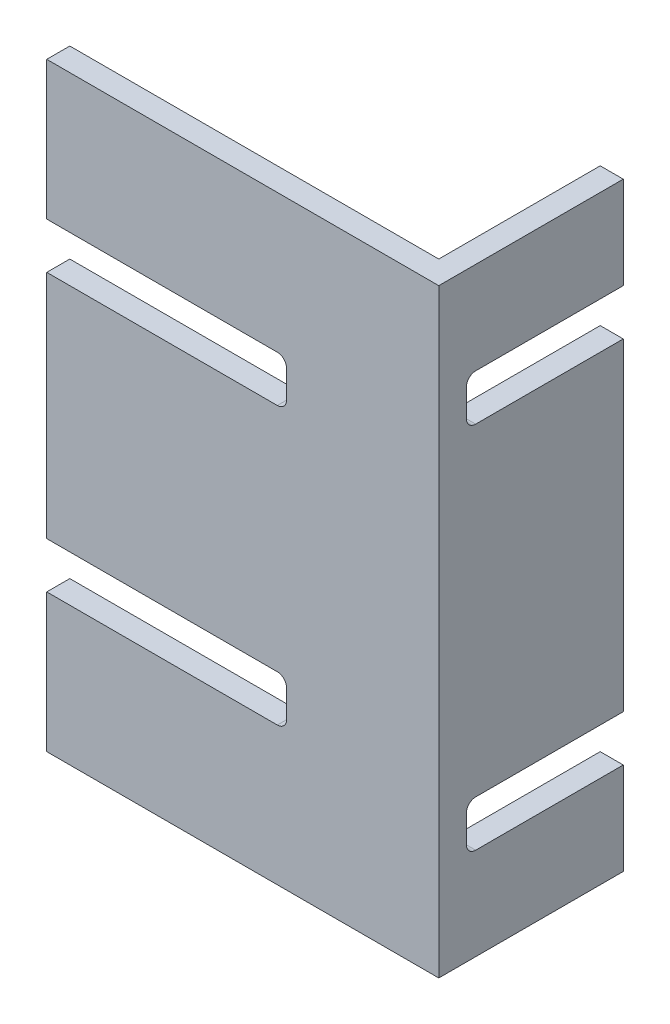
ISO-10303-21;
HEADER;
FILE_DESCRIPTION(('STEP AP214'),'2;1');
FILE_NAME('part.step','',(''),(''),'','','');
FILE_SCHEMA(('AUTOMOTIVE_DESIGN { 1 0 10303 214 1 1 1 1 }'));
ENDSEC;
DATA;
#1=APPLICATION_CONTEXT('core data for automotive mechanical design processes');
#2=APPLICATION_PROTOCOL_DEFINITION('international standard','automotive_design',2000,#1);
#3=PRODUCT_CONTEXT('',#1,'mechanical');
#4=PRODUCT('Part','Part','',(#3));
#5=PRODUCT_RELATED_PRODUCT_CATEGORY('part','',(#4));
#6=PRODUCT_DEFINITION_FORMATION('','',#4);
#7=PRODUCT_DEFINITION_CONTEXT('part definition',#1,'design');
#8=PRODUCT_DEFINITION('design','',#6,#7);
#9=PRODUCT_DEFINITION_SHAPE('','',#8);
#10=(LENGTH_UNIT() NAMED_UNIT(*) SI_UNIT(.MILLI.,.METRE.));
#11=(NAMED_UNIT(*) PLANE_ANGLE_UNIT() SI_UNIT($,.RADIAN.));
#12=(NAMED_UNIT(*) SI_UNIT($,.STERADIAN.) SOLID_ANGLE_UNIT());
#13=UNCERTAINTY_MEASURE_WITH_UNIT(LENGTH_MEASURE(1.E-05),#10,'distance_accuracy_value','');
#14=(GEOMETRIC_REPRESENTATION_CONTEXT(3) GLOBAL_UNCERTAINTY_ASSIGNED_CONTEXT((#13)) GLOBAL_UNIT_ASSIGNED_CONTEXT((#10,
#11,#12)) REPRESENTATION_CONTEXT('',''));
#15=CARTESIAN_POINT('',(0.,0.,0.));
#16=DIRECTION('',(0.,0.,1.));
#17=DIRECTION('',(1.,0.,0.));
#18=AXIS2_PLACEMENT_3D('',#15,#16,#17);
#19=CARTESIAN_POINT('',(-95.3401550608828,130.,28.7075123668189));
#20=DIRECTION('',(1.,0.,0.));
#21=DIRECTION('',(0.,0.,-1.));
#22=AXIS2_PLACEMENT_3D('',#19,#20,#21);
#23=PLANE('',#22);
#24=DIRECTION('',(0.,-1.,0.));
#25=VECTOR('',#24,1.);
#26=CARTESIAN_POINT('',(-95.3401550608828,130.,28.7075123668189));
#27=LINE('',#26,#25);
#28=CARTESIAN_POINT('',(-95.3401550608828,30.,28.7075123668189));
#29=VERTEX_POINT('',#28);
#30=CARTESIAN_POINT('',(-95.3401550608828,0.,28.7075123668189));
#31=VERTEX_POINT('',#30);
#32=EDGE_CURVE('E42',#29,#31,#27,.T.);
#33=ORIENTED_EDGE('',*,*,#32,.F.);
#34=DIRECTION('',(0.,0.,-1.));
#35=VECTOR('',#34,1.);
#36=CARTESIAN_POINT('',(-95.3401550608828,30.,33.7075123668189));
#37=LINE('',#36,#35);
#38=CARTESIAN_POINT('',(-95.3401550608828,30.,23.7075123668189));
#39=VERTEX_POINT('',#38);
#40=EDGE_CURVE('E263',#29,#39,#37,.T.);
#41=ORIENTED_EDGE('',*,*,#40,.T.);
#42=DIRECTION('',(0.,-1.,0.));
#43=VECTOR('',#42,1.);
#44=CARTESIAN_POINT('',(-95.3401550608828,130.,23.7075123668189));
#45=LINE('',#44,#43);
#46=CARTESIAN_POINT('',(-95.3401550608828,0.,23.7075123668189));
#47=VERTEX_POINT('',#46);
#48=EDGE_CURVE('E423',#39,#47,#45,.T.);
#49=ORIENTED_EDGE('',*,*,#48,.T.);
#50=DIRECTION('',(0.,0.,1.));
#51=VECTOR('',#50,1.);
#52=CARTESIAN_POINT('',(-95.3401550608828,0.,28.7075123668189));
#53=LINE('',#52,#51);
#54=EDGE_CURVE('E408',#47,#31,#53,.T.);
#55=ORIENTED_EDGE('',*,*,#54,.T.);
#56=EDGE_LOOP('',(#33,#41,#49,#55));
#57=FACE_BOUND('',#56,.T.);
#58=ADVANCED_FACE('F33',(#57),#23,.F.);
#59=CARTESIAN_POINT('',(-95.3401550608828,90.,23.7075123668189));
#60=VERTEX_POINT('',#59);
#61=CARTESIAN_POINT('',(-95.3401550608828,40.,23.7075123668189));
#62=VERTEX_POINT('',#61);
#63=EDGE_CURVE('E442',#60,#62,#45,.T.);
#64=ORIENTED_EDGE('',*,*,#63,.T.);
#65=DIRECTION('',(0.,0.,-1.));
#66=VECTOR('',#65,1.);
#67=CARTESIAN_POINT('',(-95.3401550608828,40.,33.7075123668189));
#68=LINE('',#67,#66);
#69=CARTESIAN_POINT('',(-95.3401550608828,40.,28.7075123668189));
#70=VERTEX_POINT('',#69);
#71=EDGE_CURVE('E49',#70,#62,#68,.T.);
#72=ORIENTED_EDGE('',*,*,#71,.F.);
#73=CARTESIAN_POINT('',(-95.3401550608828,90.,28.7075123668189));
#74=VERTEX_POINT('',#73);
#75=EDGE_CURVE('E41',#74,#70,#27,.T.);
#76=ORIENTED_EDGE('',*,*,#75,.F.);
#77=DIRECTION('',(0.,0.,-1.));
#78=VECTOR('',#77,1.);
#79=CARTESIAN_POINT('',(-95.3401550608828,90.,33.7075123668189));
#80=LINE('',#79,#78);
#81=EDGE_CURVE('E297',#74,#60,#80,.T.);
#82=ORIENTED_EDGE('',*,*,#81,.T.);
#83=EDGE_LOOP('',(#64,#72,#76,#82));
#84=FACE_BOUND('',#83,.T.);
#85=ADVANCED_FACE('F467',(#84),#23,.F.);
#86=CARTESIAN_POINT('',(-15.3401550608828,130.,-11.2924876331811));
#87=DIRECTION('',(0.,0.,1.));
#88=DIRECTION('',(1.,0.,0.));
#89=AXIS2_PLACEMENT_3D('',#86,#87,#88);
#90=PLANE('',#89);
#91=DIRECTION('',(0.,-1.,0.));
#92=VECTOR('',#91,1.);
#93=CARTESIAN_POINT('',(-10.3401550608828,130.,-11.2924876331811));
#94=LINE('',#93,#92);
#95=CARTESIAN_POINT('',(-10.3401550608828,100.,-11.2924876331811));
#96=VERTEX_POINT('',#95);
#97=CARTESIAN_POINT('',(-10.3401550608828,30.,-11.2924876331811));
#98=VERTEX_POINT('',#97);
#99=EDGE_CURVE('E454',#96,#98,#94,.T.);
#100=ORIENTED_EDGE('',*,*,#99,.T.);
#101=DIRECTION('',(-1.,0.,0.));
#102=VECTOR('',#101,1.);
#103=CARTESIAN_POINT('',(-5.34015506088276,30.,-11.2924876331811));
#104=LINE('',#103,#102);
#105=CARTESIAN_POINT('',(-15.3401550608828,30.,-11.2924876331811));
#106=VERTEX_POINT('',#105);
#107=EDGE_CURVE('E339',#98,#106,#104,.T.);
#108=ORIENTED_EDGE('',*,*,#107,.T.);
#109=DIRECTION('',(0.,-1.,0.));
#110=VECTOR('',#109,1.);
#111=CARTESIAN_POINT('',(-15.3401550608828,130.,-11.2924876331811));
#112=LINE('',#111,#110);
#113=CARTESIAN_POINT('',(-15.3401550608828,100.,-11.2924876331811));
#114=VERTEX_POINT('',#113);
#115=EDGE_CURVE('E450',#114,#106,#112,.T.);
#116=ORIENTED_EDGE('',*,*,#115,.F.);
#117=DIRECTION('',(-1.,0.,0.));
#118=VECTOR('',#117,1.);
#119=CARTESIAN_POINT('',(-5.34015506088276,100.,-11.2924876331811));
#120=LINE('',#119,#118);
#121=EDGE_CURVE('E380',#96,#114,#120,.T.);
#122=ORIENTED_EDGE('',*,*,#121,.F.);
#123=EDGE_LOOP('',(#100,#108,#116,#122));
#124=FACE_BOUND('',#123,.T.);
#125=ADVANCED_FACE('F521',(#124),#90,.F.);
#126=CARTESIAN_POINT('',(-10.3401550608828,130.,-11.2924876331811));
#127=VERTEX_POINT('',#126);
#128=CARTESIAN_POINT('',(-10.3401550608828,110.,-11.2924876331811));
#129=VERTEX_POINT('',#128);
#130=EDGE_CURVE('E451',#127,#129,#94,.T.);
#131=ORIENTED_EDGE('',*,*,#130,.T.);
#132=DIRECTION('',(-1.,0.,0.));
#133=VECTOR('',#132,1.);
#134=CARTESIAN_POINT('',(-5.34015506088276,110.,-11.2924876331811));
#135=LINE('',#134,#133);
#136=CARTESIAN_POINT('',(-15.3401550608828,110.,-11.2924876331811));
#137=VERTEX_POINT('',#136);
#138=EDGE_CURVE('E381',#129,#137,#135,.T.);
#139=ORIENTED_EDGE('',*,*,#138,.T.);
#140=CARTESIAN_POINT('',(-15.3401550608828,130.,-11.2924876331811));
#141=VERTEX_POINT('',#140);
#142=EDGE_CURVE('E446',#141,#137,#112,.T.);
#143=ORIENTED_EDGE('',*,*,#142,.F.);
#144=DIRECTION('',(-1.,0.,0.));
#145=VECTOR('',#144,1.);
#146=CARTESIAN_POINT('',(-15.3401550608828,130.,-11.2924876331811));
#147=LINE('',#146,#145);
#148=EDGE_CURVE('E417',#127,#141,#147,.T.);
#149=ORIENTED_EDGE('',*,*,#148,.F.);
#150=EDGE_LOOP('',(#131,#139,#143,#149));
#151=FACE_BOUND('',#150,.T.);
#152=ADVANCED_FACE('F523',(#151),#90,.F.);
#153=CARTESIAN_POINT('',(-95.3401550608828,130.,23.7075123668189));
#154=VERTEX_POINT('',#153);
#155=CARTESIAN_POINT('',(-95.3401550608828,100.,23.7075123668189));
#156=VERTEX_POINT('',#155);
#157=EDGE_CURVE('E438',#154,#156,#45,.T.);
#158=ORIENTED_EDGE('',*,*,#157,.T.);
#159=DIRECTION('',(0.,0.,-1.));
#160=VECTOR('',#159,1.);
#161=CARTESIAN_POINT('',(-95.3401550608828,100.,33.7075123668189));
#162=LINE('',#161,#160);
#163=CARTESIAN_POINT('',(-95.3401550608828,100.,28.7075123668189));
#164=VERTEX_POINT('',#163);
#165=EDGE_CURVE('E57',#164,#156,#162,.T.);
#166=ORIENTED_EDGE('',*,*,#165,.F.);
#167=CARTESIAN_POINT('',(-95.3401550608828,130.,28.7075123668189));
#168=VERTEX_POINT('',#167);
#169=EDGE_CURVE('E11',#168,#164,#27,.T.);
#170=ORIENTED_EDGE('',*,*,#169,.F.);
#171=DIRECTION('',(0.,0.,1.));
#172=VECTOR('',#171,1.);
#173=CARTESIAN_POINT('',(-95.3401550608828,130.,28.7075123668189));
#174=LINE('',#173,#172);
#175=EDGE_CURVE('E409',#154,#168,#174,.T.);
#176=ORIENTED_EDGE('',*,*,#175,.F.);
#177=EDGE_LOOP('',(#158,#166,#170,#176));
#178=FACE_BOUND('',#177,.T.);
#179=ADVANCED_FACE('F35',(#178),#23,.F.);
#180=CARTESIAN_POINT('',(-10.3401550608828,130.,28.7075123668189));
#181=DIRECTION('',(0.,0.,-1.));
#182=DIRECTION('',(-1.,0.,0.));
#183=AXIS2_PLACEMENT_3D('',#180,#181,#182);
#184=PLANE('',#183);
#185=CARTESIAN_POINT('',(-45.3401550608828,32.,28.7075123668189));
#186=DIRECTION('',(0.,0.,-1.));
#187=DIRECTION('',(-1.,0.,0.));
#188=AXIS2_PLACEMENT_3D('',#185,#186,#187);
#189=CIRCLE('',#188,2.);
#190=CARTESIAN_POINT('',(-43.3401550608828,32.,28.7075123668189));
#191=VERTEX_POINT('',#190);
#192=CARTESIAN_POINT('',(-45.3401550608828,30.,28.7075123668189));
#193=VERTEX_POINT('',#192);
#194=EDGE_CURVE('E278',#191,#193,#189,.T.);
#195=ORIENTED_EDGE('',*,*,#194,.T.);
#196=DIRECTION('',(-1.,0.,0.));
#197=VECTOR('',#196,1.);
#198=CARTESIAN_POINT('',(-10.3401550608828,30.,28.7075123668189));
#199=LINE('',#198,#197);
#200=EDGE_CURVE('E281',#193,#29,#199,.T.);
#201=ORIENTED_EDGE('',*,*,#200,.T.);
#202=ORIENTED_EDGE('',*,*,#32,.T.);
#203=DIRECTION('',(1.,0.,0.));
#204=VECTOR('',#203,1.);
#205=CARTESIAN_POINT('',(-10.3401550608828,0.,28.7075123668189));
#206=LINE('',#205,#204);
#207=CARTESIAN_POINT('',(-10.3401550608828,0.,28.7075123668189));
#208=VERTEX_POINT('',#207);
#209=EDGE_CURVE('E426',#31,#208,#206,.T.);
#210=ORIENTED_EDGE('',*,*,#209,.T.);
#211=DIRECTION('',(0.,-1.,0.));
#212=VECTOR('',#211,1.);
#213=CARTESIAN_POINT('',(-10.3401550608828,130.,28.7075123668189));
#214=LINE('',#213,#212);
#215=CARTESIAN_POINT('',(-10.3401550608828,130.,28.7075123668189));
#216=VERTEX_POINT('',#215);
#217=EDGE_CURVE('E453',#216,#208,#214,.T.);
#218=ORIENTED_EDGE('',*,*,#217,.F.);
#219=DIRECTION('',(1.,0.,0.));
#220=VECTOR('',#219,1.);
#221=CARTESIAN_POINT('',(-10.3401550608828,130.,28.7075123668189));
#222=LINE('',#221,#220);
#223=EDGE_CURVE('E412',#168,#216,#222,.T.);
#224=ORIENTED_EDGE('',*,*,#223,.F.);
#225=ORIENTED_EDGE('',*,*,#169,.T.);
#226=DIRECTION('',(1.,0.,0.));
#227=VECTOR('',#226,1.);
#228=CARTESIAN_POINT('',(-10.3401550608828,100.,28.7075123668189));
#229=LINE('',#228,#227);
#230=CARTESIAN_POINT('',(-45.3401550608828,100.,28.7075123668189));
#231=VERTEX_POINT('',#230);
#232=EDGE_CURVE('E300',#164,#231,#229,.T.);
#233=ORIENTED_EDGE('',*,*,#232,.T.);
#234=CARTESIAN_POINT('',(-45.3401550608828,98.,28.7075123668189));
#235=DIRECTION('',(0.,0.,-1.));
#236=DIRECTION('',(-1.,0.,0.));
#237=AXIS2_PLACEMENT_3D('',#234,#235,#236);
#238=CIRCLE('',#237,2.);
#239=CARTESIAN_POINT('',(-43.3401550608828,98.,28.7075123668189));
#240=VERTEX_POINT('',#239);
#241=EDGE_CURVE('E312',#231,#240,#238,.T.);
#242=ORIENTED_EDGE('',*,*,#241,.T.);
#243=DIRECTION('',(0.,-1.,0.));
#244=VECTOR('',#243,1.);
#245=CARTESIAN_POINT('',(-43.3401550608828,130.,28.7075123668189));
#246=LINE('',#245,#244);
#247=CARTESIAN_POINT('',(-43.3401550608828,92.,28.7075123668189));
#248=VERTEX_POINT('',#247);
#249=EDGE_CURVE('E315',#240,#248,#246,.T.);
#250=ORIENTED_EDGE('',*,*,#249,.T.);
#251=CARTESIAN_POINT('',(-45.3401550608828,92.,28.7075123668189));
#252=DIRECTION('',(0.,0.,-1.));
#253=DIRECTION('',(-1.,0.,0.));
#254=AXIS2_PLACEMENT_3D('',#251,#252,#253);
#255=CIRCLE('',#254,1.99999999999999);
#256=CARTESIAN_POINT('',(-45.3401550608828,90.,28.7075123668189));
#257=VERTEX_POINT('',#256);
#258=EDGE_CURVE('E318',#248,#257,#255,.T.);
#259=ORIENTED_EDGE('',*,*,#258,.T.);
#260=DIRECTION('',(-1.,0.,0.));
#261=VECTOR('',#260,1.);
#262=CARTESIAN_POINT('',(-10.3401550608828,90.,28.7075123668189));
#263=LINE('',#262,#261);
#264=EDGE_CURVE('E321',#257,#74,#263,.T.);
#265=ORIENTED_EDGE('',*,*,#264,.T.);
#266=ORIENTED_EDGE('',*,*,#75,.T.);
#267=DIRECTION('',(1.,0.,0.));
#268=VECTOR('',#267,1.);
#269=CARTESIAN_POINT('',(-10.3401550608828,40.,28.7075123668189));
#270=LINE('',#269,#268);
#271=CARTESIAN_POINT('',(-45.3401550608828,40.,28.7075123668189));
#272=VERTEX_POINT('',#271);
#273=EDGE_CURVE('E266',#70,#272,#270,.T.);
#274=ORIENTED_EDGE('',*,*,#273,.T.);
#275=CARTESIAN_POINT('',(-45.3401550608828,38.,28.7075123668189));
#276=DIRECTION('',(0.,0.,-1.));
#277=DIRECTION('',(-1.,0.,0.));
#278=AXIS2_PLACEMENT_3D('',#275,#276,#277);
#279=CIRCLE('',#278,2.);
#280=CARTESIAN_POINT('',(-43.3401550608828,38.,28.7075123668189));
#281=VERTEX_POINT('',#280);
#282=EDGE_CURVE('E240',#272,#281,#279,.T.);
#283=ORIENTED_EDGE('',*,*,#282,.T.);
#284=DIRECTION('',(0.,-1.,0.));
#285=VECTOR('',#284,1.);
#286=CARTESIAN_POINT('',(-43.3401550608828,130.,28.7075123668189));
#287=LINE('',#286,#285);
#288=EDGE_CURVE('E275',#281,#191,#287,.T.);
#289=ORIENTED_EDGE('',*,*,#288,.T.);
#290=EDGE_LOOP('',(#195,#201,#202,#210,#218,#224,#225,#233,#242,#250,#259,#265,#266,#274,#283,#289));
#291=FACE_BOUND('',#290,.T.);
#292=ADVANCED_FACE('F465',(#291),#184,.F.);
#293=CARTESIAN_POINT('',(-10.3401550608828,130.,-11.2924876331811));
#294=DIRECTION('',(-1.,0.,0.));
#295=DIRECTION('',(0.,0.,1.));
#296=AXIS2_PLACEMENT_3D('',#293,#294,#295);
#297=PLANE('',#296);
#298=CARTESIAN_POINT('',(-10.3401550608828,28.,20.7075123668189));
#299=DIRECTION('',(-1.,0.,0.));
#300=DIRECTION('',(0.,0.,1.));
#301=AXIS2_PLACEMENT_3D('',#298,#299,#300);
#302=CIRCLE('',#301,2.);
#303=CARTESIAN_POINT('',(-10.3401550608828,28.,22.7075123668189));
#304=VERTEX_POINT('',#303);
#305=CARTESIAN_POINT('',(-10.3401550608828,30.,20.7075123668189));
#306=VERTEX_POINT('',#305);
#307=EDGE_CURVE('E360',#304,#306,#302,.T.);
#308=ORIENTED_EDGE('',*,*,#307,.T.);
#309=DIRECTION('',(0.,0.,-1.));
#310=VECTOR('',#309,1.);
#311=CARTESIAN_POINT('',(-10.3401550608828,30.,-11.2924876331811));
#312=LINE('',#311,#310);
#313=EDGE_CURVE('E363',#306,#98,#312,.T.);
#314=ORIENTED_EDGE('',*,*,#313,.T.);
#315=ORIENTED_EDGE('',*,*,#99,.F.);
#316=DIRECTION('',(0.,0.,1.));
#317=VECTOR('',#316,1.);
#318=CARTESIAN_POINT('',(-10.3401550608828,100.,-11.2924876331811));
#319=LINE('',#318,#317);
#320=CARTESIAN_POINT('',(-10.3401550608828,100.,20.7075123668189));
#321=VERTEX_POINT('',#320);
#322=EDGE_CURVE('E384',#96,#321,#319,.T.);
#323=ORIENTED_EDGE('',*,*,#322,.T.);
#324=CARTESIAN_POINT('',(-10.3401550608828,102.,20.7075123668189));
#325=DIRECTION('',(-1.,0.,0.));
#326=DIRECTION('',(0.,0.,1.));
#327=AXIS2_PLACEMENT_3D('',#324,#325,#326);
#328=CIRCLE('',#327,2.);
#329=CARTESIAN_POINT('',(-10.3401550608828,102.,22.7075123668189));
#330=VERTEX_POINT('',#329);
#331=EDGE_CURVE('E396',#321,#330,#328,.T.);
#332=ORIENTED_EDGE('',*,*,#331,.T.);
#333=DIRECTION('',(0.,1.,0.));
#334=VECTOR('',#333,1.);
#335=CARTESIAN_POINT('',(-10.3401550608828,130.,22.7075123668189));
#336=LINE('',#335,#334);
#337=CARTESIAN_POINT('',(-10.3401550608828,108.,22.7075123668189));
#338=VERTEX_POINT('',#337);
#339=EDGE_CURVE('E399',#330,#338,#336,.T.);
#340=ORIENTED_EDGE('',*,*,#339,.T.);
#341=CARTESIAN_POINT('',(-10.3401550608828,108.,20.7075123668189));
#342=DIRECTION('',(-1.,0.,0.));
#343=DIRECTION('',(0.,0.,1.));
#344=AXIS2_PLACEMENT_3D('',#341,#342,#343);
#345=CIRCLE('',#344,2.);
#346=CARTESIAN_POINT('',(-10.3401550608828,110.,20.7075123668189));
#347=VERTEX_POINT('',#346);
#348=EDGE_CURVE('E402',#338,#347,#345,.T.);
#349=ORIENTED_EDGE('',*,*,#348,.T.);
#350=DIRECTION('',(0.,0.,-1.));
#351=VECTOR('',#350,1.);
#352=CARTESIAN_POINT('',(-10.3401550608828,110.,-11.2924876331811));
#353=LINE('',#352,#351);
#354=EDGE_CURVE('E405',#347,#129,#353,.T.);
#355=ORIENTED_EDGE('',*,*,#354,.T.);
#356=ORIENTED_EDGE('',*,*,#130,.F.);
#357=DIRECTION('',(0.,0.,-1.));
#358=VECTOR('',#357,1.);
#359=CARTESIAN_POINT('',(-10.3401550608828,130.,-11.2924876331811));
#360=LINE('',#359,#358);
#361=EDGE_CURVE('E415',#216,#127,#360,.T.);
#362=ORIENTED_EDGE('',*,*,#361,.F.);
#363=ORIENTED_EDGE('',*,*,#217,.T.);
#364=DIRECTION('',(0.,0.,-1.));
#365=VECTOR('',#364,1.);
#366=CARTESIAN_POINT('',(-10.3401550608828,0.,-11.2924876331811));
#367=LINE('',#366,#365);
#368=CARTESIAN_POINT('',(-10.3401550608828,0.,-11.2924876331811));
#369=VERTEX_POINT('',#368);
#370=EDGE_CURVE('E428',#208,#369,#367,.T.);
#371=ORIENTED_EDGE('',*,*,#370,.T.);
#372=CARTESIAN_POINT('',(-10.3401550608828,20.,-11.2924876331811));
#373=VERTEX_POINT('',#372);
#374=EDGE_CURVE('E449',#373,#369,#94,.T.);
#375=ORIENTED_EDGE('',*,*,#374,.F.);
#376=DIRECTION('',(0.,0.,1.));
#377=VECTOR('',#376,1.);
#378=CARTESIAN_POINT('',(-10.3401550608828,20.,-11.2924876331811));
#379=LINE('',#378,#377);
#380=CARTESIAN_POINT('',(-10.3401550608828,20.,20.7075123668189));
#381=VERTEX_POINT('',#380);
#382=EDGE_CURVE('E342',#373,#381,#379,.T.);
#383=ORIENTED_EDGE('',*,*,#382,.T.);
#384=CARTESIAN_POINT('',(-10.3401550608828,22.,20.7075123668189));
#385=DIRECTION('',(-1.,0.,0.));
#386=DIRECTION('',(0.,0.,1.));
#387=AXIS2_PLACEMENT_3D('',#384,#385,#386);
#388=CIRCLE('',#387,2.);
#389=CARTESIAN_POINT('',(-10.3401550608828,22.,22.7075123668189));
#390=VERTEX_POINT('',#389);
#391=EDGE_CURVE('E354',#381,#390,#388,.T.);
#392=ORIENTED_EDGE('',*,*,#391,.T.);
#393=DIRECTION('',(0.,1.,0.));
#394=VECTOR('',#393,1.);
#395=CARTESIAN_POINT('',(-10.3401550608828,130.,22.7075123668189));
#396=LINE('',#395,#394);
#397=EDGE_CURVE('E357',#390,#304,#396,.T.);
#398=ORIENTED_EDGE('',*,*,#397,.T.);
#399=EDGE_LOOP('',(#308,#314,#315,#323,#332,#340,#349,#355,#356,#362,#363,#371,#375,#383,#392,#398));
#400=FACE_BOUND('',#399,.T.);
#401=ADVANCED_FACE('F480',(#400),#297,.F.);
#402=CARTESIAN_POINT('',(-15.3401550608828,20.,-11.2924876331811));
#403=VERTEX_POINT('',#402);
#404=CARTESIAN_POINT('',(-15.3401550608828,0.,-11.2924876331811));
#405=VERTEX_POINT('',#404);
#406=EDGE_CURVE('E445',#403,#405,#112,.T.);
#407=ORIENTED_EDGE('',*,*,#406,.F.);
#408=DIRECTION('',(-1.,0.,0.));
#409=VECTOR('',#408,1.);
#410=CARTESIAN_POINT('',(-5.34015506088276,20.,-11.2924876331811));
#411=LINE('',#410,#409);
#412=EDGE_CURVE('E338',#373,#403,#411,.T.);
#413=ORIENTED_EDGE('',*,*,#412,.F.);
#414=ORIENTED_EDGE('',*,*,#374,.T.);
#415=DIRECTION('',(-1.,0.,0.));
#416=VECTOR('',#415,1.);
#417=CARTESIAN_POINT('',(-15.3401550608828,0.,-11.2924876331811));
#418=LINE('',#417,#416);
#419=EDGE_CURVE('E431',#369,#405,#418,.T.);
#420=ORIENTED_EDGE('',*,*,#419,.T.);
#421=EDGE_LOOP('',(#407,#413,#414,#420));
#422=FACE_BOUND('',#421,.T.);
#423=ADVANCED_FACE('F530',(#422),#90,.F.);
#424=CARTESIAN_POINT('',(-15.3401550608828,130.,23.7075123668189));
#425=DIRECTION('',(1.,0.,0.));
#426=DIRECTION('',(0.,0.,-1.));
#427=AXIS2_PLACEMENT_3D('',#424,#425,#426);
#428=PLANE('',#427);
#429=ORIENTED_EDGE('',*,*,#115,.T.);
#430=DIRECTION('',(0.,0.,-1.));
#431=VECTOR('',#430,1.);
#432=CARTESIAN_POINT('',(-15.3401550608828,30.,-11.2924876331811));
#433=LINE('',#432,#431);
#434=CARTESIAN_POINT('',(-15.3401550608828,30.,20.7075123668189));
#435=VERTEX_POINT('',#434);
#436=EDGE_CURVE('E336',#435,#106,#433,.T.);
#437=ORIENTED_EDGE('',*,*,#436,.F.);
#438=CARTESIAN_POINT('',(-15.3401550608828,28.,20.7075123668189));
#439=DIRECTION('',(-1.,0.,0.));
#440=DIRECTION('',(0.,0.,1.));
#441=AXIS2_PLACEMENT_3D('',#438,#439,#440);
#442=CIRCLE('',#441,2.);
#443=CARTESIAN_POINT('',(-15.3401550608828,28.,22.7075123668189));
#444=VERTEX_POINT('',#443);
#445=EDGE_CURVE('E333',#444,#435,#442,.T.);
#446=ORIENTED_EDGE('',*,*,#445,.F.);
#447=DIRECTION('',(0.,1.,0.));
#448=VECTOR('',#447,1.);
#449=CARTESIAN_POINT('',(-15.3401550608828,28.,22.7075123668189));
#450=LINE('',#449,#448);
#451=CARTESIAN_POINT('',(-15.3401550608828,22.,22.7075123668189));
#452=VERTEX_POINT('',#451);
#453=EDGE_CURVE('E330',#452,#444,#450,.T.);
#454=ORIENTED_EDGE('',*,*,#453,.F.);
#455=CARTESIAN_POINT('',(-15.3401550608828,22.,20.7075123668189));
#456=DIRECTION('',(-1.,0.,0.));
#457=DIRECTION('',(0.,0.,-1.));
#458=AXIS2_PLACEMENT_3D('',#455,#456,#457);
#459=CIRCLE('',#458,2.);
#460=CARTESIAN_POINT('',(-15.3401550608828,20.,20.7075123668189));
#461=VERTEX_POINT('',#460);
#462=EDGE_CURVE('E327',#461,#452,#459,.T.);
#463=ORIENTED_EDGE('',*,*,#462,.F.);
#464=DIRECTION('',(0.,0.,1.));
#465=VECTOR('',#464,1.);
#466=CARTESIAN_POINT('',(-15.3401550608828,20.,-11.2924876331811));
#467=LINE('',#466,#465);
#468=EDGE_CURVE('E324',#403,#461,#467,.T.);
#469=ORIENTED_EDGE('',*,*,#468,.F.);
#470=ORIENTED_EDGE('',*,*,#406,.T.);
#471=DIRECTION('',(0.,0.,1.));
#472=VECTOR('',#471,1.);
#473=CARTESIAN_POINT('',(-15.3401550608828,0.,23.7075123668189));
#474=LINE('',#473,#472);
#475=CARTESIAN_POINT('',(-15.3401550608828,0.,23.7075123668189));
#476=VERTEX_POINT('',#475);
#477=EDGE_CURVE('E434',#405,#476,#474,.T.);
#478=ORIENTED_EDGE('',*,*,#477,.T.);
#479=DIRECTION('',(0.,-1.,0.));
#480=VECTOR('',#479,1.);
#481=CARTESIAN_POINT('',(-15.3401550608828,130.,23.7075123668189));
#482=LINE('',#481,#480);
#483=CARTESIAN_POINT('',(-15.3401550608828,130.,23.7075123668189));
#484=VERTEX_POINT('',#483);
#485=EDGE_CURVE('E441',#484,#476,#482,.T.);
#486=ORIENTED_EDGE('',*,*,#485,.F.);
#487=DIRECTION('',(0.,0.,1.));
#488=VECTOR('',#487,1.);
#489=CARTESIAN_POINT('',(-15.3401550608828,130.,23.7075123668189));
#490=LINE('',#489,#488);
#491=EDGE_CURVE('E419',#141,#484,#490,.T.);
#492=ORIENTED_EDGE('',*,*,#491,.F.);
#493=ORIENTED_EDGE('',*,*,#142,.T.);
#494=DIRECTION('',(0.,0.,-1.));
#495=VECTOR('',#494,1.);
#496=CARTESIAN_POINT('',(-15.3401550608828,110.,-11.2924876331811));
#497=LINE('',#496,#495);
#498=CARTESIAN_POINT('',(-15.3401550608828,110.,20.7075123668189));
#499=VERTEX_POINT('',#498);
#500=EDGE_CURVE('E378',#499,#137,#497,.T.);
#501=ORIENTED_EDGE('',*,*,#500,.F.);
#502=CARTESIAN_POINT('',(-15.3401550608828,108.,20.7075123668189));
#503=DIRECTION('',(-1.,0.,0.));
#504=DIRECTION('',(0.,0.,1.));
#505=AXIS2_PLACEMENT_3D('',#502,#503,#504);
#506=CIRCLE('',#505,2.);
#507=CARTESIAN_POINT('',(-15.3401550608828,108.,22.7075123668189));
#508=VERTEX_POINT('',#507);
#509=EDGE_CURVE('E375',#508,#499,#506,.T.);
#510=ORIENTED_EDGE('',*,*,#509,.F.);
#511=DIRECTION('',(0.,1.,0.));
#512=VECTOR('',#511,1.);
#513=CARTESIAN_POINT('',(-15.3401550608828,108.,22.7075123668189));
#514=LINE('',#513,#512);
#515=CARTESIAN_POINT('',(-15.3401550608828,102.,22.7075123668189));
#516=VERTEX_POINT('',#515);
#517=EDGE_CURVE('E372',#516,#508,#514,.T.);
#518=ORIENTED_EDGE('',*,*,#517,.F.);
#519=CARTESIAN_POINT('',(-15.3401550608828,102.,20.7075123668189));
#520=DIRECTION('',(-1.,0.,0.));
#521=DIRECTION('',(0.,0.,-1.));
#522=AXIS2_PLACEMENT_3D('',#519,#520,#521);
#523=CIRCLE('',#522,2.);
#524=CARTESIAN_POINT('',(-15.3401550608828,100.,20.7075123668189));
#525=VERTEX_POINT('',#524);
#526=EDGE_CURVE('E369',#525,#516,#523,.T.);
#527=ORIENTED_EDGE('',*,*,#526,.F.);
#528=DIRECTION('',(0.,0.,1.));
#529=VECTOR('',#528,1.);
#530=CARTESIAN_POINT('',(-15.3401550608828,100.,-11.2924876331811));
#531=LINE('',#530,#529);
#532=EDGE_CURVE('E366',#114,#525,#531,.T.);
#533=ORIENTED_EDGE('',*,*,#532,.F.);
#534=EDGE_LOOP('',(#429,#437,#446,#454,#463,#469,#470,#478,#486,#492,#493,#501,#510,#518,#527,#533));
#535=FACE_BOUND('',#534,.T.);
#536=ADVANCED_FACE('F538',(#535),#428,.F.);
#537=CARTESIAN_POINT('',(-95.3401550608828,130.,23.7075123668189));
#538=DIRECTION('',(0.,0.,1.));
#539=DIRECTION('',(1.,0.,0.));
#540=AXIS2_PLACEMENT_3D('',#537,#538,#539);
#541=PLANE('',#540);
#542=ORIENTED_EDGE('',*,*,#48,.F.);
#543=DIRECTION('',(-1.,0.,0.));
#544=VECTOR('',#543,1.);
#545=CARTESIAN_POINT('',(-95.3401550608828,30.,23.7075123668189));
#546=LINE('',#545,#544);
#547=CARTESIAN_POINT('',(-45.3401550608828,30.,23.7075123668189));
#548=VERTEX_POINT('',#547);
#549=EDGE_CURVE('E261',#548,#39,#546,.T.);
#550=ORIENTED_EDGE('',*,*,#549,.F.);
#551=CARTESIAN_POINT('',(-45.3401550608828,32.,23.7075123668189));
#552=DIRECTION('',(0.,0.,-1.));
#553=DIRECTION('',(-1.,0.,0.));
#554=AXIS2_PLACEMENT_3D('',#551,#552,#553);
#555=CIRCLE('',#554,2.);
#556=CARTESIAN_POINT('',(-43.3401550608828,32.,23.7075123668189));
#557=VERTEX_POINT('',#556);
#558=EDGE_CURVE('E256',#557,#548,#555,.T.);
#559=ORIENTED_EDGE('',*,*,#558,.F.);
#560=DIRECTION('',(0.,-1.,0.));
#561=VECTOR('',#560,1.);
#562=CARTESIAN_POINT('',(-43.3401550608828,38.,23.7075123668189));
#563=LINE('',#562,#561);
#564=CARTESIAN_POINT('',(-43.3401550608828,38.,23.7075123668189));
#565=VERTEX_POINT('',#564);
#566=EDGE_CURVE('E254',#565,#557,#563,.T.);
#567=ORIENTED_EDGE('',*,*,#566,.F.);
#568=CARTESIAN_POINT('',(-45.3401550608828,38.,23.7075123668189));
#569=DIRECTION('',(0.,0.,-1.));
#570=DIRECTION('',(1.,0.,0.));
#571=AXIS2_PLACEMENT_3D('',#568,#569,#570);
#572=CIRCLE('',#571,2.);
#573=CARTESIAN_POINT('',(-45.3401550608828,40.,23.7075123668189));
#574=VERTEX_POINT('',#573);
#575=EDGE_CURVE('E237',#574,#565,#572,.T.);
#576=ORIENTED_EDGE('',*,*,#575,.F.);
#577=DIRECTION('',(1.,0.,0.));
#578=VECTOR('',#577,1.);
#579=CARTESIAN_POINT('',(-95.3401550608828,40.,23.7075123668189));
#580=LINE('',#579,#578);
#581=EDGE_CURVE('E244',#62,#574,#580,.T.);
#582=ORIENTED_EDGE('',*,*,#581,.F.);
#583=ORIENTED_EDGE('',*,*,#63,.F.);
#584=DIRECTION('',(-1.,0.,0.));
#585=VECTOR('',#584,1.);
#586=CARTESIAN_POINT('',(-95.3401550608828,90.,23.7075123668189));
#587=LINE('',#586,#585);
#588=CARTESIAN_POINT('',(-45.3401550608828,90.,23.7075123668189));
#589=VERTEX_POINT('',#588);
#590=EDGE_CURVE('E295',#589,#60,#587,.T.);
#591=ORIENTED_EDGE('',*,*,#590,.F.);
#592=CARTESIAN_POINT('',(-45.3401550608828,92.,23.7075123668189));
#593=DIRECTION('',(0.,0.,-1.));
#594=DIRECTION('',(-1.,0.,0.));
#595=AXIS2_PLACEMENT_3D('',#592,#593,#594);
#596=CIRCLE('',#595,1.99999999999999);
#597=CARTESIAN_POINT('',(-43.3401550608828,92.,23.7075123668189));
#598=VERTEX_POINT('',#597);
#599=EDGE_CURVE('E292',#598,#589,#596,.T.);
#600=ORIENTED_EDGE('',*,*,#599,.F.);
#601=DIRECTION('',(0.,-1.,0.));
#602=VECTOR('',#601,1.);
#603=CARTESIAN_POINT('',(-43.3401550608828,98.,23.7075123668189));
#604=LINE('',#603,#602);
#605=CARTESIAN_POINT('',(-43.3401550608828,98.,23.7075123668189));
#606=VERTEX_POINT('',#605);
#607=EDGE_CURVE('E289',#606,#598,#604,.T.);
#608=ORIENTED_EDGE('',*,*,#607,.F.);
#609=CARTESIAN_POINT('',(-45.3401550608828,98.,23.7075123668189));
#610=DIRECTION('',(0.,0.,-1.));
#611=DIRECTION('',(1.,0.,0.));
#612=AXIS2_PLACEMENT_3D('',#609,#610,#611);
#613=CIRCLE('',#612,2.);
#614=CARTESIAN_POINT('',(-45.3401550608828,100.,23.7075123668189));
#615=VERTEX_POINT('',#614);
#616=EDGE_CURVE('E286',#615,#606,#613,.T.);
#617=ORIENTED_EDGE('',*,*,#616,.F.);
#618=DIRECTION('',(1.,0.,0.));
#619=VECTOR('',#618,1.);
#620=CARTESIAN_POINT('',(-95.3401550608828,100.,23.7075123668189));
#621=LINE('',#620,#619);
#622=EDGE_CURVE('E284',#156,#615,#621,.T.);
#623=ORIENTED_EDGE('',*,*,#622,.F.);
#624=ORIENTED_EDGE('',*,*,#157,.F.);
#625=DIRECTION('',(-1.,0.,0.));
#626=VECTOR('',#625,1.);
#627=CARTESIAN_POINT('',(-95.3401550608828,130.,23.7075123668189));
#628=LINE('',#627,#626);
#629=EDGE_CURVE('E421',#484,#154,#628,.T.);
#630=ORIENTED_EDGE('',*,*,#629,.F.);
#631=ORIENTED_EDGE('',*,*,#485,.T.);
#632=DIRECTION('',(-1.,0.,0.));
#633=VECTOR('',#632,1.);
#634=CARTESIAN_POINT('',(-95.3401550608828,0.,23.7075123668189));
#635=LINE('',#634,#633);
#636=EDGE_CURVE('E413',#476,#47,#635,.T.);
#637=ORIENTED_EDGE('',*,*,#636,.T.);
#638=EDGE_LOOP('',(#542,#550,#559,#567,#576,#582,#583,#591,#600,#608,#617,#623,#624,#630,#631,#637));
#639=FACE_BOUND('',#638,.T.);
#640=ADVANCED_FACE('F251',(#639),#541,.F.);
#641=CARTESIAN_POINT('',(0.,130.,0.));
#642=DIRECTION('',(0.,-1.,0.));
#643=DIRECTION('',(0.,0.,-1.));
#644=AXIS2_PLACEMENT_3D('',#641,#642,#643);
#645=PLANE('',#644);
#646=ORIENTED_EDGE('',*,*,#175,.T.);
#647=ORIENTED_EDGE('',*,*,#223,.T.);
#648=ORIENTED_EDGE('',*,*,#361,.T.);
#649=ORIENTED_EDGE('',*,*,#148,.T.);
#650=ORIENTED_EDGE('',*,*,#491,.T.);
#651=ORIENTED_EDGE('',*,*,#629,.T.);
#652=EDGE_LOOP('',(#646,#647,#648,#649,#650,#651));
#653=FACE_BOUND('',#652,.T.);
#654=ADVANCED_FACE('F483',(#653),#645,.F.);
#655=CARTESIAN_POINT('',(0.,0.,0.));
#656=DIRECTION('',(0.,-1.,0.));
#657=DIRECTION('',(0.,0.,-1.));
#658=AXIS2_PLACEMENT_3D('',#655,#656,#657);
#659=PLANE('',#658);
#660=ORIENTED_EDGE('',*,*,#54,.F.);
#661=ORIENTED_EDGE('',*,*,#636,.F.);
#662=ORIENTED_EDGE('',*,*,#477,.F.);
#663=ORIENTED_EDGE('',*,*,#419,.F.);
#664=ORIENTED_EDGE('',*,*,#370,.F.);
#665=ORIENTED_EDGE('',*,*,#209,.F.);
#666=EDGE_LOOP('',(#660,#661,#662,#663,#664,#665));
#667=FACE_BOUND('',#666,.T.);
#668=ADVANCED_FACE('F477',(#667),#659,.T.);
#669=CARTESIAN_POINT('',(-5.34015506088276,110.,-11.2924876331811));
#670=DIRECTION('',(0.,1.,0.));
#671=DIRECTION('',(0.,0.,1.));
#672=AXIS2_PLACEMENT_3D('',#669,#670,#671);
#673=PLANE('',#672);
#674=DIRECTION('',(-1.,0.,0.));
#675=VECTOR('',#674,1.);
#676=CARTESIAN_POINT('',(-5.34015506088276,110.,20.7075123668189));
#677=LINE('',#676,#675);
#678=EDGE_CURVE('E385',#347,#499,#677,.T.);
#679=ORIENTED_EDGE('',*,*,#678,.T.);
#680=ORIENTED_EDGE('',*,*,#500,.T.);
#681=ORIENTED_EDGE('',*,*,#138,.F.);
#682=ORIENTED_EDGE('',*,*,#354,.F.);
#683=EDGE_LOOP('',(#679,#680,#681,#682));
#684=FACE_BOUND('',#683,.T.);
#685=ADVANCED_FACE('F575',(#684),#673,.F.);
#686=CARTESIAN_POINT('',(-5.34015506088276,108.,20.7075123668189));
#687=DIRECTION('',(-1.,0.,0.));
#688=DIRECTION('',(0.,0.,1.));
#689=AXIS2_PLACEMENT_3D('',#686,#687,#688);
#690=CYLINDRICAL_SURFACE('',#689,2.);
#691=DIRECTION('',(-1.,0.,0.));
#692=VECTOR('',#691,1.);
#693=CARTESIAN_POINT('',(-5.34015506088276,108.,22.7075123668189));
#694=LINE('',#693,#692);
#695=EDGE_CURVE('E387',#338,#508,#694,.T.);
#696=ORIENTED_EDGE('',*,*,#695,.T.);
#697=ORIENTED_EDGE('',*,*,#509,.T.);
#698=ORIENTED_EDGE('',*,*,#678,.F.);
#699=ORIENTED_EDGE('',*,*,#348,.F.);
#700=EDGE_LOOP('',(#696,#697,#698,#699));
#701=FACE_BOUND('',#700,.T.);
#702=ADVANCED_FACE('F579',(#701),#690,.F.);
#703=CARTESIAN_POINT('',(-5.34015506088276,108.,22.7075123668189));
#704=DIRECTION('',(0.,0.,1.));
#705=DIRECTION('',(1.,0.,0.));
#706=AXIS2_PLACEMENT_3D('',#703,#704,#705);
#707=PLANE('',#706);
#708=DIRECTION('',(-1.,0.,0.));
#709=VECTOR('',#708,1.);
#710=CARTESIAN_POINT('',(-5.34015506088276,102.,22.7075123668189));
#711=LINE('',#710,#709);
#712=EDGE_CURVE('E389',#330,#516,#711,.T.);
#713=ORIENTED_EDGE('',*,*,#712,.T.);
#714=ORIENTED_EDGE('',*,*,#517,.T.);
#715=ORIENTED_EDGE('',*,*,#695,.F.);
#716=ORIENTED_EDGE('',*,*,#339,.F.);
#717=EDGE_LOOP('',(#713,#714,#715,#716));
#718=FACE_BOUND('',#717,.T.);
#719=ADVANCED_FACE('F581',(#718),#707,.F.);
#720=CARTESIAN_POINT('',(-5.34015506088276,102.,20.7075123668189));
#721=DIRECTION('',(-1.,0.,0.));
#722=DIRECTION('',(0.,0.,1.));
#723=AXIS2_PLACEMENT_3D('',#720,#721,#722);
#724=CYLINDRICAL_SURFACE('',#723,2.);
#725=DIRECTION('',(-1.,0.,0.));
#726=VECTOR('',#725,1.);
#727=CARTESIAN_POINT('',(-5.34015506088276,100.,20.7075123668189));
#728=LINE('',#727,#726);
#729=EDGE_CURVE('E391',#321,#525,#728,.T.);
#730=ORIENTED_EDGE('',*,*,#729,.T.);
#731=ORIENTED_EDGE('',*,*,#526,.T.);
#732=ORIENTED_EDGE('',*,*,#712,.F.);
#733=ORIENTED_EDGE('',*,*,#331,.F.);
#734=EDGE_LOOP('',(#730,#731,#732,#733));
#735=FACE_BOUND('',#734,.T.);
#736=ADVANCED_FACE('F585',(#735),#724,.F.);
#737=CARTESIAN_POINT('',(-5.34015506088276,100.,-11.2924876331811));
#738=DIRECTION('',(0.,-1.,0.));
#739=DIRECTION('',(0.,0.,-1.));
#740=AXIS2_PLACEMENT_3D('',#737,#738,#739);
#741=PLANE('',#740);
#742=ORIENTED_EDGE('',*,*,#121,.T.);
#743=ORIENTED_EDGE('',*,*,#532,.T.);
#744=ORIENTED_EDGE('',*,*,#729,.F.);
#745=ORIENTED_EDGE('',*,*,#322,.F.);
#746=EDGE_LOOP('',(#742,#743,#744,#745));
#747=FACE_BOUND('',#746,.T.);
#748=ADVANCED_FACE('F588',(#747),#741,.F.);
#749=CARTESIAN_POINT('',(-5.34015506088276,30.,-11.2924876331811));
#750=DIRECTION('',(0.,1.,0.));
#751=DIRECTION('',(0.,0.,1.));
#752=AXIS2_PLACEMENT_3D('',#749,#750,#751);
#753=PLANE('',#752);
#754=DIRECTION('',(-1.,0.,0.));
#755=VECTOR('',#754,1.);
#756=CARTESIAN_POINT('',(-5.34015506088276,30.,20.7075123668189));
#757=LINE('',#756,#755);
#758=EDGE_CURVE('E343',#306,#435,#757,.T.);
#759=ORIENTED_EDGE('',*,*,#758,.T.);
#760=ORIENTED_EDGE('',*,*,#436,.T.);
#761=ORIENTED_EDGE('',*,*,#107,.F.);
#762=ORIENTED_EDGE('',*,*,#313,.F.);
#763=EDGE_LOOP('',(#759,#760,#761,#762));
#764=FACE_BOUND('',#763,.T.);
#765=ADVANCED_FACE('F559',(#764),#753,.F.);
#766=CARTESIAN_POINT('',(-5.34015506088276,28.,20.7075123668189));
#767=DIRECTION('',(-1.,0.,0.));
#768=DIRECTION('',(0.,0.,1.));
#769=AXIS2_PLACEMENT_3D('',#766,#767,#768);
#770=CYLINDRICAL_SURFACE('',#769,2.);
#771=DIRECTION('',(-1.,0.,0.));
#772=VECTOR('',#771,1.);
#773=CARTESIAN_POINT('',(-5.34015506088276,28.,22.7075123668189));
#774=LINE('',#773,#772);
#775=EDGE_CURVE('E345',#304,#444,#774,.T.);
#776=ORIENTED_EDGE('',*,*,#775,.T.);
#777=ORIENTED_EDGE('',*,*,#445,.T.);
#778=ORIENTED_EDGE('',*,*,#758,.F.);
#779=ORIENTED_EDGE('',*,*,#307,.F.);
#780=EDGE_LOOP('',(#776,#777,#778,#779));
#781=FACE_BOUND('',#780,.T.);
#782=ADVANCED_FACE('F563',(#781),#770,.F.);
#783=CARTESIAN_POINT('',(-5.34015506088276,28.,22.7075123668189));
#784=DIRECTION('',(0.,0.,1.));
#785=DIRECTION('',(1.,0.,0.));
#786=AXIS2_PLACEMENT_3D('',#783,#784,#785);
#787=PLANE('',#786);
#788=DIRECTION('',(-1.,0.,0.));
#789=VECTOR('',#788,1.);
#790=CARTESIAN_POINT('',(-5.34015506088276,22.,22.7075123668189));
#791=LINE('',#790,#789);
#792=EDGE_CURVE('E347',#390,#452,#791,.T.);
#793=ORIENTED_EDGE('',*,*,#792,.T.);
#794=ORIENTED_EDGE('',*,*,#453,.T.);
#795=ORIENTED_EDGE('',*,*,#775,.F.);
#796=ORIENTED_EDGE('',*,*,#397,.F.);
#797=EDGE_LOOP('',(#793,#794,#795,#796));
#798=FACE_BOUND('',#797,.T.);
#799=ADVANCED_FACE('F565',(#798),#787,.F.);
#800=CARTESIAN_POINT('',(-5.34015506088276,22.,20.7075123668189));
#801=DIRECTION('',(-1.,0.,0.));
#802=DIRECTION('',(0.,0.,1.));
#803=AXIS2_PLACEMENT_3D('',#800,#801,#802);
#804=CYLINDRICAL_SURFACE('',#803,2.);
#805=DIRECTION('',(-1.,0.,0.));
#806=VECTOR('',#805,1.);
#807=CARTESIAN_POINT('',(-5.34015506088276,20.,20.7075123668189));
#808=LINE('',#807,#806);
#809=EDGE_CURVE('E349',#381,#461,#808,.T.);
#810=ORIENTED_EDGE('',*,*,#809,.T.);
#811=ORIENTED_EDGE('',*,*,#462,.T.);
#812=ORIENTED_EDGE('',*,*,#792,.F.);
#813=ORIENTED_EDGE('',*,*,#391,.F.);
#814=EDGE_LOOP('',(#810,#811,#812,#813));
#815=FACE_BOUND('',#814,.T.);
#816=ADVANCED_FACE('F513',(#815),#804,.F.);
#817=CARTESIAN_POINT('',(-5.34015506088276,20.,-11.2924876331811));
#818=DIRECTION('',(0.,-1.,0.));
#819=DIRECTION('',(0.,0.,-1.));
#820=AXIS2_PLACEMENT_3D('',#817,#818,#819);
#821=PLANE('',#820);
#822=ORIENTED_EDGE('',*,*,#412,.T.);
#823=ORIENTED_EDGE('',*,*,#468,.T.);
#824=ORIENTED_EDGE('',*,*,#809,.F.);
#825=ORIENTED_EDGE('',*,*,#382,.F.);
#826=EDGE_LOOP('',(#822,#823,#824,#825));
#827=FACE_BOUND('',#826,.T.);
#828=ADVANCED_FACE('F506',(#827),#821,.F.);
#829=CARTESIAN_POINT('',(-95.3401550608828,90.,33.7075123668189));
#830=DIRECTION('',(0.,-1.,0.));
#831=DIRECTION('',(0.,0.,-1.));
#832=AXIS2_PLACEMENT_3D('',#829,#830,#831);
#833=PLANE('',#832);
#834=DIRECTION('',(0.,0.,-1.));
#835=VECTOR('',#834,1.);
#836=CARTESIAN_POINT('',(-45.3401550608828,90.,33.7075123668189));
#837=LINE('',#836,#835);
#838=EDGE_CURVE('E301',#257,#589,#837,.T.);
#839=ORIENTED_EDGE('',*,*,#838,.T.);
#840=ORIENTED_EDGE('',*,*,#590,.T.);
#841=ORIENTED_EDGE('',*,*,#81,.F.);
#842=ORIENTED_EDGE('',*,*,#264,.F.);
#843=EDGE_LOOP('',(#839,#840,#841,#842));
#844=FACE_BOUND('',#843,.T.);
#845=ADVANCED_FACE('F504',(#844),#833,.F.);
#846=CARTESIAN_POINT('',(-45.3401550608828,92.,33.7075123668189));
#847=DIRECTION('',(0.,0.,-1.));
#848=DIRECTION('',(-1.,0.,0.));
#849=AXIS2_PLACEMENT_3D('',#846,#847,#848);
#850=CYLINDRICAL_SURFACE('',#849,1.99999999999999);
#851=DIRECTION('',(0.,0.,-1.));
#852=VECTOR('',#851,1.);
#853=CARTESIAN_POINT('',(-43.3401550608828,92.,33.7075123668189));
#854=LINE('',#853,#852);
#855=EDGE_CURVE('E303',#248,#598,#854,.T.);
#856=ORIENTED_EDGE('',*,*,#855,.T.);
#857=ORIENTED_EDGE('',*,*,#599,.T.);
#858=ORIENTED_EDGE('',*,*,#838,.F.);
#859=ORIENTED_EDGE('',*,*,#258,.F.);
#860=EDGE_LOOP('',(#856,#857,#858,#859));
#861=FACE_BOUND('',#860,.T.);
#862=ADVANCED_FACE('F502',(#861),#850,.F.);
#863=CARTESIAN_POINT('',(-43.3401550608828,98.,33.7075123668189));
#864=DIRECTION('',(1.,0.,0.));
#865=DIRECTION('',(0.,0.,-1.));
#866=AXIS2_PLACEMENT_3D('',#863,#864,#865);
#867=PLANE('',#866);
#868=DIRECTION('',(0.,0.,-1.));
#869=VECTOR('',#868,1.);
#870=CARTESIAN_POINT('',(-43.3401550608828,98.,33.7075123668189));
#871=LINE('',#870,#869);
#872=EDGE_CURVE('E305',#240,#606,#871,.T.);
#873=ORIENTED_EDGE('',*,*,#872,.T.);
#874=ORIENTED_EDGE('',*,*,#607,.T.);
#875=ORIENTED_EDGE('',*,*,#855,.F.);
#876=ORIENTED_EDGE('',*,*,#249,.F.);
#877=EDGE_LOOP('',(#873,#874,#875,#876));
#878=FACE_BOUND('',#877,.T.);
#879=ADVANCED_FACE('F497',(#878),#867,.F.);
#880=CARTESIAN_POINT('',(-45.3401550608828,98.,33.7075123668189));
#881=DIRECTION('',(0.,0.,-1.));
#882=DIRECTION('',(-1.,0.,0.));
#883=AXIS2_PLACEMENT_3D('',#880,#881,#882);
#884=CYLINDRICAL_SURFACE('',#883,2.);
#885=DIRECTION('',(0.,0.,-1.));
#886=VECTOR('',#885,1.);
#887=CARTESIAN_POINT('',(-45.3401550608828,100.,33.7075123668189));
#888=LINE('',#887,#886);
#889=EDGE_CURVE('E307',#231,#615,#888,.T.);
#890=ORIENTED_EDGE('',*,*,#889,.T.);
#891=ORIENTED_EDGE('',*,*,#616,.T.);
#892=ORIENTED_EDGE('',*,*,#872,.F.);
#893=ORIENTED_EDGE('',*,*,#241,.F.);
#894=EDGE_LOOP('',(#890,#891,#892,#893));
#895=FACE_BOUND('',#894,.T.);
#896=ADVANCED_FACE('F493',(#895),#884,.F.);
#897=CARTESIAN_POINT('',(-95.3401550608828,100.,33.7075123668189));
#898=DIRECTION('',(0.,1.,0.));
#899=DIRECTION('',(0.,0.,1.));
#900=AXIS2_PLACEMENT_3D('',#897,#898,#899);
#901=PLANE('',#900);
#902=ORIENTED_EDGE('',*,*,#165,.T.);
#903=ORIENTED_EDGE('',*,*,#622,.T.);
#904=ORIENTED_EDGE('',*,*,#889,.F.);
#905=ORIENTED_EDGE('',*,*,#232,.F.);
#906=EDGE_LOOP('',(#902,#903,#904,#905));
#907=FACE_BOUND('',#906,.T.);
#908=ADVANCED_FACE('F490',(#907),#901,.F.);
#909=CARTESIAN_POINT('',(-95.3401550608828,30.,33.7075123668189));
#910=DIRECTION('',(0.,-1.,0.));
#911=DIRECTION('',(1.,0.,0.));
#912=AXIS2_PLACEMENT_3D('',#909,#910,#911);
#913=PLANE('',#912);
#914=DIRECTION('',(0.,0.,-1.));
#915=VECTOR('',#914,1.);
#916=CARTESIAN_POINT('',(-45.3401550608828,30.,33.7075123668189));
#917=LINE('',#916,#915);
#918=EDGE_CURVE('E267',#193,#548,#917,.T.);
#919=ORIENTED_EDGE('',*,*,#918,.T.);
#920=ORIENTED_EDGE('',*,*,#549,.T.);
#921=ORIENTED_EDGE('',*,*,#40,.F.);
#922=ORIENTED_EDGE('',*,*,#200,.F.);
#923=EDGE_LOOP('',(#919,#920,#921,#922));
#924=FACE_BOUND('',#923,.T.);
#925=ADVANCED_FACE('F766',(#924),#913,.F.);
#926=CARTESIAN_POINT('',(-45.3401550608828,32.,33.7075123668189));
#927=DIRECTION('',(0.,0.,-1.));
#928=DIRECTION('',(-1.,0.,0.));
#929=AXIS2_PLACEMENT_3D('',#926,#927,#928);
#930=CYLINDRICAL_SURFACE('',#929,2.);
#931=DIRECTION('',(0.,0.,-1.));
#932=VECTOR('',#931,1.);
#933=CARTESIAN_POINT('',(-43.3401550608828,32.,33.7075123668189));
#934=LINE('',#933,#932);
#935=EDGE_CURVE('E269',#191,#557,#934,.T.);
#936=ORIENTED_EDGE('',*,*,#935,.T.);
#937=ORIENTED_EDGE('',*,*,#558,.T.);
#938=ORIENTED_EDGE('',*,*,#918,.F.);
#939=ORIENTED_EDGE('',*,*,#194,.F.);
#940=EDGE_LOOP('',(#936,#937,#938,#939));
#941=FACE_BOUND('',#940,.T.);
#942=ADVANCED_FACE('F774',(#941),#930,.F.);
#943=CARTESIAN_POINT('',(-43.3401550608828,38.,33.7075123668189));
#944=DIRECTION('',(1.,0.,0.));
#945=DIRECTION('',(0.,0.,-1.));
#946=AXIS2_PLACEMENT_3D('',#943,#944,#945);
#947=PLANE('',#946);
#948=DIRECTION('',(0.,0.,-1.));
#949=VECTOR('',#948,1.);
#950=CARTESIAN_POINT('',(-43.3401550608828,38.,33.7075123668189));
#951=LINE('',#950,#949);
#952=EDGE_CURVE('E242',#281,#565,#951,.T.);
#953=ORIENTED_EDGE('',*,*,#952,.T.);
#954=ORIENTED_EDGE('',*,*,#566,.T.);
#955=ORIENTED_EDGE('',*,*,#935,.F.);
#956=ORIENTED_EDGE('',*,*,#288,.F.);
#957=EDGE_LOOP('',(#953,#954,#955,#956));
#958=FACE_BOUND('',#957,.T.);
#959=ADVANCED_FACE('F783',(#958),#947,.F.);
#960=CARTESIAN_POINT('',(-45.3401550608828,38.,33.7075123668189));
#961=DIRECTION('',(0.,0.,-1.));
#962=DIRECTION('',(-1.,0.,0.));
#963=AXIS2_PLACEMENT_3D('',#960,#961,#962);
#964=CYLINDRICAL_SURFACE('',#963,2.);
#965=DIRECTION('',(0.,0.,-1.));
#966=VECTOR('',#965,1.);
#967=CARTESIAN_POINT('',(-45.3401550608828,40.,33.7075123668189));
#968=LINE('',#967,#966);
#969=EDGE_CURVE('E233',#272,#574,#968,.T.);
#970=ORIENTED_EDGE('',*,*,#969,.T.);
#971=ORIENTED_EDGE('',*,*,#575,.T.);
#972=ORIENTED_EDGE('',*,*,#952,.F.);
#973=ORIENTED_EDGE('',*,*,#282,.F.);
#974=EDGE_LOOP('',(#970,#971,#972,#973));
#975=FACE_BOUND('',#974,.T.);
#976=ADVANCED_FACE('F234',(#975),#964,.F.);
#977=CARTESIAN_POINT('',(-95.3401550608828,40.,33.7075123668189));
#978=DIRECTION('',(0.,1.,0.));
#979=DIRECTION('',(-1.,0.,0.));
#980=AXIS2_PLACEMENT_3D('',#977,#978,#979);
#981=PLANE('',#980);
#982=ORIENTED_EDGE('',*,*,#71,.T.);
#983=ORIENTED_EDGE('',*,*,#581,.T.);
#984=ORIENTED_EDGE('',*,*,#969,.F.);
#985=ORIENTED_EDGE('',*,*,#273,.F.);
#986=EDGE_LOOP('',(#982,#983,#984,#985));
#987=FACE_BOUND('',#986,.T.);
#988=ADVANCED_FACE('F245',(#987),#981,.F.);
#989=CLOSED_SHELL('',(#58,#85,#125,#152,#179,#292,#401,#423,#536,#640,#654,#668,#685,#702,#719,
#736,#748,#765,#782,#799,#816,#828,#845,#862,#879,#896,#908,#925,#942,#959,#976,#988));
#990=MANIFOLD_SOLID_BREP('B2',#989);
#991=ADVANCED_BREP_SHAPE_REPRESENTATION('',(#18,#990),#14);
#992=SHAPE_DEFINITION_REPRESENTATION(#9,#991);
ENDSEC;
END-ISO-10303-21;
